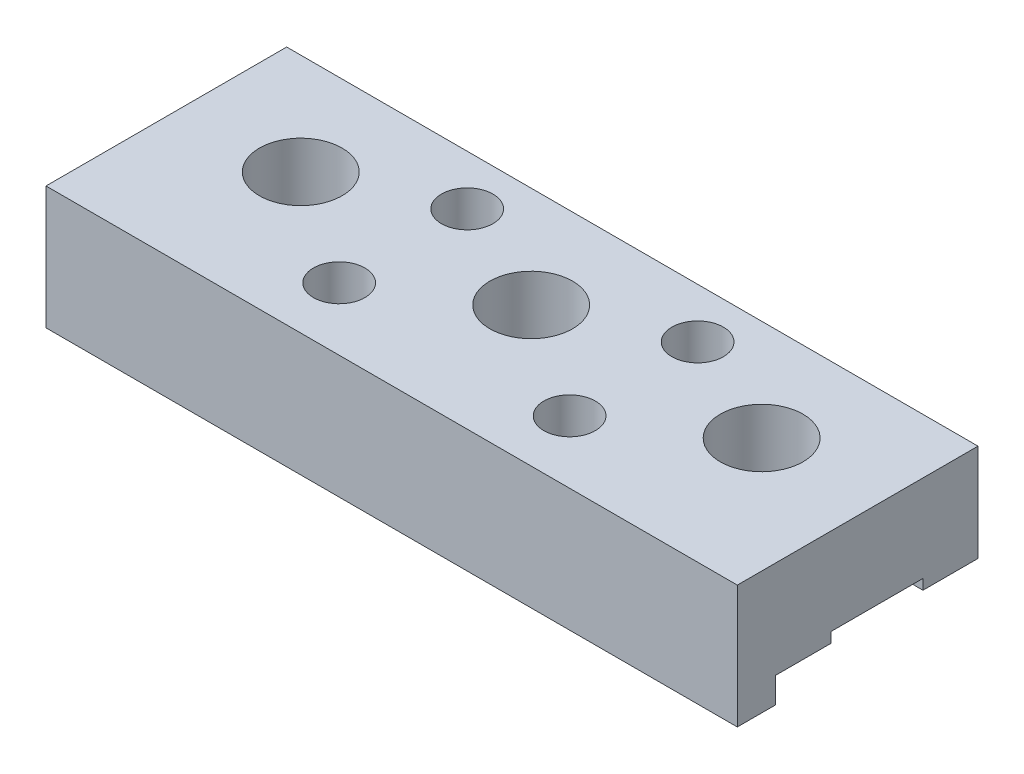
ISO-10303-21;
HEADER;
FILE_DESCRIPTION(('STEP AP214'),'2;1');
FILE_NAME('part.step','',(''),(''),'','','');
FILE_SCHEMA(('AUTOMOTIVE_DESIGN { 1 0 10303 214 1 1 1 1 }'));
ENDSEC;
DATA;
#1=APPLICATION_CONTEXT('core data for automotive mechanical design processes');
#2=APPLICATION_PROTOCOL_DEFINITION('international standard','automotive_design',2000,#1);
#3=PRODUCT_CONTEXT('',#1,'mechanical');
#4=PRODUCT('Part','Part','',(#3));
#5=PRODUCT_RELATED_PRODUCT_CATEGORY('part','',(#4));
#6=PRODUCT_DEFINITION_FORMATION('','',#4);
#7=PRODUCT_DEFINITION_CONTEXT('part definition',#1,'design');
#8=PRODUCT_DEFINITION('design','',#6,#7);
#9=PRODUCT_DEFINITION_SHAPE('','',#8);
#10=(LENGTH_UNIT() NAMED_UNIT(*) SI_UNIT(.MILLI.,.METRE.));
#11=(NAMED_UNIT(*) PLANE_ANGLE_UNIT() SI_UNIT($,.RADIAN.));
#12=(NAMED_UNIT(*) SI_UNIT($,.STERADIAN.) SOLID_ANGLE_UNIT());
#13=UNCERTAINTY_MEASURE_WITH_UNIT(LENGTH_MEASURE(1.E-05),#10,'distance_accuracy_value','');
#14=(GEOMETRIC_REPRESENTATION_CONTEXT(3) GLOBAL_UNCERTAINTY_ASSIGNED_CONTEXT((#13)) GLOBAL_UNIT_ASSIGNED_CONTEXT((#10,
#11,#12)) REPRESENTATION_CONTEXT('',''));
#15=CARTESIAN_POINT('',(0.,0.,0.));
#16=DIRECTION('',(0.,0.,1.));
#17=DIRECTION('',(1.,0.,0.));
#18=AXIS2_PLACEMENT_3D('',#15,#16,#17);
#19=CARTESIAN_POINT('',(-34.2899999999999,1.01600000000013,-4.62279999999993));
#20=DIRECTION('',(0.,0.,-1.));
#21=DIRECTION('',(-1.,0.,0.));
#22=AXIS2_PLACEMENT_3D('',#19,#20,#21);
#23=PLANE('',#22);
#24=DIRECTION('',(1.,0.,0.));
#25=VECTOR('',#24,1.);
#26=CARTESIAN_POINT('',(-34.2899999999999,-2.22044604925031E-13,-4.62279999999987));
#27=LINE('',#26,#25);
#28=CARTESIAN_POINT('',(-34.2899999999999,-2.22044604925031E-13,-4.62279999999987));
#29=VERTEX_POINT('',#28);
#30=CARTESIAN_POINT('',(-13.9316421186892,-2.22044604925031E-13,-4.62279999999987));
#31=VERTEX_POINT('',#30);
#32=EDGE_CURVE('E177',#29,#31,#27,.T.);
#33=ORIENTED_EDGE('',*,*,#32,.T.);
#34=DIRECTION('',(0.,1.,0.));
#35=VECTOR('',#34,1.);
#36=CARTESIAN_POINT('',(-13.9316421186892,9.65199999999977,-4.62279999999987));
#37=LINE('',#36,#35);
#38=CARTESIAN_POINT('',(-13.9316421186892,1.01599999999968,-4.62279999999993));
#39=VERTEX_POINT('',#38);
#40=EDGE_CURVE('E165',#31,#39,#37,.T.);
#41=ORIENTED_EDGE('',*,*,#40,.T.);
#42=DIRECTION('',(1.,0.,0.));
#43=VECTOR('',#42,1.);
#44=CARTESIAN_POINT('',(-34.2899999999999,1.01600000000013,-4.62279999999993));
#45=LINE('',#44,#43);
#46=CARTESIAN_POINT('',(-34.2899999999999,1.01600000000013,-4.62279999999993));
#47=VERTEX_POINT('',#46);
#48=EDGE_CURVE('E174',#47,#39,#45,.T.);
#49=ORIENTED_EDGE('',*,*,#48,.F.);
#50=DIRECTION('',(0.,-1.,0.));
#51=VECTOR('',#50,1.);
#52=CARTESIAN_POINT('',(-34.2899999999999,1.01600000000013,-4.62279999999993));
#53=LINE('',#52,#51);
#54=EDGE_CURVE('E367',#47,#29,#53,.T.);
#55=ORIENTED_EDGE('',*,*,#54,.T.);
#56=EDGE_LOOP('',(#33,#41,#49,#55));
#57=FACE_BOUND('',#56,.T.);
#58=ADVANCED_FACE('F42',(#57),#23,.F.);
#59=CARTESIAN_POINT('',(-34.2900000000002,-73.7657517975891,9.98220000000005));
#60=DIRECTION('',(0.,0.,-1.));
#61=DIRECTION('',(-1.,0.,0.));
#62=AXIS2_PLACEMENT_3D('',#59,#60,#61);
#63=PLANE('',#62);
#64=DIRECTION('',(0.,1.,0.));
#65=VECTOR('',#64,1.);
#66=CARTESIAN_POINT('',(-12.2628915235492,9.65199999999977,9.9822));
#67=LINE('',#66,#65);
#68=CARTESIAN_POINT('',(-12.262891523549,-2.54000000000021,9.9822));
#69=VERTEX_POINT('',#68);
#70=CARTESIAN_POINT('',(-12.262891523549,-2.22044604925031E-13,9.98220000000005));
#71=VERTEX_POINT('',#70);
#72=EDGE_CURVE('E236',#69,#71,#67,.T.);
#73=ORIENTED_EDGE('',*,*,#72,.F.);
#74=DIRECTION('',(1.,0.,0.));
#75=VECTOR('',#74,1.);
#76=CARTESIAN_POINT('',(-34.2899999999999,-2.54000000000043,9.98220000000005));
#77=LINE('',#76,#75);
#78=CARTESIAN_POINT('',(-34.2899999999999,-2.54000000000043,9.98220000000005));
#79=VERTEX_POINT('',#78);
#80=EDGE_CURVE('E287',#79,#69,#77,.T.);
#81=ORIENTED_EDGE('',*,*,#80,.F.);
#82=DIRECTION('',(0.,1.,0.));
#83=VECTOR('',#82,1.);
#84=CARTESIAN_POINT('',(-34.2900000000002,-73.7657517975891,9.98220000000005));
#85=LINE('',#84,#83);
#86=CARTESIAN_POINT('',(-34.2899999999999,0.,9.98220000000011));
#87=VERTEX_POINT('',#86);
#88=EDGE_CURVE('E286',#79,#87,#85,.T.);
#89=ORIENTED_EDGE('',*,*,#88,.T.);
#90=DIRECTION('',(-1.,0.,0.));
#91=VECTOR('',#90,1.);
#92=CARTESIAN_POINT('',(34.2899999999999,0.,9.98220000000008));
#93=LINE('',#92,#91);
#94=EDGE_CURVE('E310',#71,#87,#93,.T.);
#95=ORIENTED_EDGE('',*,*,#94,.F.);
#96=EDGE_LOOP('',(#73,#81,#89,#95));
#97=FACE_BOUND('',#96,.T.);
#98=ADVANCED_FACE('F398',(#97),#63,.T.);
#99=DIRECTION('',(0.,1.,0.));
#100=VECTOR('',#99,1.);
#101=CARTESIAN_POINT('',(-10.5971084764509,9.65199999999977,9.9822));
#102=LINE('',#101,#100);
#103=CARTESIAN_POINT('',(-10.5971084764509,-2.22044604925031E-13,9.98220000000005));
#104=VERTEX_POINT('',#103);
#105=CARTESIAN_POINT('',(-10.5971084764509,-2.54000000000021,9.9822));
#106=VERTEX_POINT('',#105);
#107=EDGE_CURVE('E64',#104,#106,#102,.F.);
#108=ORIENTED_EDGE('',*,*,#107,.F.);
#109=CARTESIAN_POINT('',(10.5971084764509,-4.44089209850063E-13,9.98220000000011));
#110=VERTEX_POINT('',#109);
#111=EDGE_CURVE('E320',#110,#104,#93,.T.);
#112=ORIENTED_EDGE('',*,*,#111,.F.);
#113=DIRECTION('',(0.,1.,0.));
#114=VECTOR('',#113,1.);
#115=CARTESIAN_POINT('',(10.5971084764509,9.65199999999955,9.98219999999994));
#116=LINE('',#115,#114);
#117=CARTESIAN_POINT('',(10.5971084764509,-2.54000000000043,9.98220000000005));
#118=VERTEX_POINT('',#117);
#119=EDGE_CURVE('E226',#118,#110,#116,.T.);
#120=ORIENTED_EDGE('',*,*,#119,.F.);
#121=EDGE_CURVE('E291',#106,#118,#77,.T.);
#122=ORIENTED_EDGE('',*,*,#121,.F.);
#123=EDGE_LOOP('',(#108,#112,#120,#122));
#124=FACE_BOUND('',#123,.T.);
#125=ADVANCED_FACE('F341',(#124),#63,.T.);
#126=CARTESIAN_POINT('',(-8.92835788131086,1.01599999999991,-4.62280000000009));
#127=VERTEX_POINT('',#126);
#128=CARTESIAN_POINT('',(8.92835788131086,1.01599999999991,-4.62280000000004));
#129=VERTEX_POINT('',#128);
#130=EDGE_CURVE('E187',#127,#129,#45,.T.);
#131=ORIENTED_EDGE('',*,*,#130,.F.);
#132=DIRECTION('',(0.,1.,0.));
#133=VECTOR('',#132,1.);
#134=CARTESIAN_POINT('',(-8.92835788131086,9.65199999999999,-4.62279999999987));
#135=LINE('',#134,#133);
#136=CARTESIAN_POINT('',(-8.92835788131086,0.,-4.62279999999998));
#137=VERTEX_POINT('',#136);
#138=EDGE_CURVE('E56',#127,#137,#135,.F.);
#139=ORIENTED_EDGE('',*,*,#138,.T.);
#140=CARTESIAN_POINT('',(8.92835788131086,0.,-4.62279999999998));
#141=VERTEX_POINT('',#140);
#142=EDGE_CURVE('E567',#137,#141,#27,.T.);
#143=ORIENTED_EDGE('',*,*,#142,.T.);
#144=DIRECTION('',(0.,1.,0.));
#145=VECTOR('',#144,1.);
#146=CARTESIAN_POINT('',(8.92835788131063,9.65199999999999,-4.62279999999987));
#147=LINE('',#146,#145);
#148=EDGE_CURVE('E328',#141,#129,#147,.T.);
#149=ORIENTED_EDGE('',*,*,#148,.T.);
#150=EDGE_LOOP('',(#131,#139,#143,#149));
#151=FACE_BOUND('',#150,.T.);
#152=ADVANCED_FACE('F393',(#151),#23,.F.);
#153=CARTESIAN_POINT('',(34.2900000000002,0.,11.43));
#154=DIRECTION('',(0.,1.,0.));
#155=DIRECTION('',(0.,0.,1.));
#156=AXIS2_PLACEMENT_3D('',#153,#154,#155);
#157=PLANE('',#156);
#158=ORIENTED_EDGE('',*,*,#142,.F.);
#159=CARTESIAN_POINT('',(-11.4300000000001,-2.22044604925031E-13,-5.13080000000005));
#160=DIRECTION('',(0.,1.,0.));
#161=DIRECTION('',(0.,0.,1.));
#162=AXIS2_PLACEMENT_3D('',#159,#160,#161);
#163=CIRCLE('',#162,2.5527);
#164=EDGE_CURVE('E179',#137,#31,#163,.T.);
#165=ORIENTED_EDGE('',*,*,#164,.T.);
#166=ORIENTED_EDGE('',*,*,#32,.F.);
#167=DIRECTION('',(0.,0.,1.));
#168=VECTOR('',#167,1.);
#169=CARTESIAN_POINT('',(-34.2899999999999,0.,-11.4300000000001));
#170=LINE('',#169,#168);
#171=CARTESIAN_POINT('',(-34.2899999999999,0.,-10.0838));
#172=VERTEX_POINT('',#171);
#173=EDGE_CURVE('E308',#172,#29,#170,.T.);
#174=ORIENTED_EDGE('',*,*,#173,.F.);
#175=DIRECTION('',(-1.,0.,0.));
#176=VECTOR('',#175,1.);
#177=CARTESIAN_POINT('',(34.2899999999999,0.,-10.0837999999999));
#178=LINE('',#177,#176);
#179=CARTESIAN_POINT('',(34.2899999999999,0.,-10.0837999999999));
#180=VERTEX_POINT('',#179);
#181=EDGE_CURVE('E210',#180,#172,#178,.T.);
#182=ORIENTED_EDGE('',*,*,#181,.F.);
#183=DIRECTION('',(0.,0.,-1.));
#184=VECTOR('',#183,1.);
#185=CARTESIAN_POINT('',(34.2899999999999,0.,-11.43));
#186=LINE('',#185,#184);
#187=CARTESIAN_POINT('',(34.2899999999999,0.,-4.62280000000001));
#188=VERTEX_POINT('',#187);
#189=EDGE_CURVE('E304',#188,#180,#186,.T.);
#190=ORIENTED_EDGE('',*,*,#189,.F.);
#191=CARTESIAN_POINT('',(13.9316421186892,0.,-4.62280000000004));
#192=VERTEX_POINT('',#191);
#193=EDGE_CURVE('E418',#192,#188,#27,.T.);
#194=ORIENTED_EDGE('',*,*,#193,.F.);
#195=CARTESIAN_POINT('',(11.4300000000001,-2.22044604925031E-13,-5.13080000000005));
#196=DIRECTION('',(0.,1.,0.));
#197=DIRECTION('',(0.,0.,1.));
#198=AXIS2_PLACEMENT_3D('',#195,#196,#197);
#199=CIRCLE('',#198,2.5527);
#200=EDGE_CURVE('E212',#192,#141,#199,.T.);
#201=ORIENTED_EDGE('',*,*,#200,.T.);
#202=EDGE_LOOP('',(#158,#165,#166,#174,#182,#190,#194,#201));
#203=FACE_BOUND('',#202,.T.);
#204=ADVANCED_FACE('F384',(#203),#157,.F.);
#205=CARTESIAN_POINT('',(0.,0.,-0.0508000000000175));
#206=DIRECTION('',(0.,-1.,0.));
#207=DIRECTION('',(0.,0.,-1.));
#208=AXIS2_PLACEMENT_3D('',#205,#206,#207);
#209=CYLINDRICAL_SURFACE('',#208,4.1021);
#210=CARTESIAN_POINT('',(0.,9.65199999999999,-0.050800000000073));
#211=DIRECTION('',(0.,-1.,0.));
#212=DIRECTION('',(0.,0.,-1.));
#213=AXIS2_PLACEMENT_3D('',#210,#211,#212);
#214=CIRCLE('',#213,4.1021);
#215=CARTESIAN_POINT('',(0.,9.652,-4.15290000000007));
#216=VERTEX_POINT('',#215);
#217=EDGE_CURVE('E273',#216,#216,#214,.T.);
#218=ORIENTED_EDGE('',*,*,#217,.F.);
#219=EDGE_LOOP('',(#218));
#220=FACE_BOUND('',#219,.T.);
#221=CARTESIAN_POINT('',(0.,1.01599999999991,-0.0508000000000175));
#222=DIRECTION('',(0.,-1.,0.));
#223=DIRECTION('',(0.,0.,-1.));
#224=AXIS2_PLACEMENT_3D('',#221,#222,#223);
#225=CIRCLE('',#224,4.1021);
#226=CARTESIAN_POINT('',(0.,1.01599999999991,-4.15290000000002));
#227=VERTEX_POINT('',#226);
#228=EDGE_CURVE('E376',#227,#227,#225,.F.);
#229=ORIENTED_EDGE('',*,*,#228,.F.);
#230=EDGE_LOOP('',(#229));
#231=FACE_BOUND('',#230,.T.);
#232=ADVANCED_FACE('F381',(#220,#231),#209,.F.);
#233=CARTESIAN_POINT('',(22.8600000000001,0.,-0.0507999999999342));
#234=DIRECTION('',(0.,-1.,0.));
#235=DIRECTION('',(0.,0.,-1.));
#236=AXIS2_PLACEMENT_3D('',#233,#234,#235);
#237=CYLINDRICAL_SURFACE('',#236,4.1021);
#238=CARTESIAN_POINT('',(22.8599999999999,9.65199999999977,-0.0507999999999342));
#239=DIRECTION('',(0.,-1.,0.));
#240=DIRECTION('',(0.,0.,-1.));
#241=AXIS2_PLACEMENT_3D('',#238,#239,#240);
#242=CIRCLE('',#241,4.1021);
#243=CARTESIAN_POINT('',(22.8599999999999,9.65199999999977,-4.15289999999993));
#244=VERTEX_POINT('',#243);
#245=EDGE_CURVE('E270',#244,#244,#242,.T.);
#246=ORIENTED_EDGE('',*,*,#245,.F.);
#247=EDGE_LOOP('',(#246));
#248=FACE_BOUND('',#247,.T.);
#249=CARTESIAN_POINT('',(22.8600000000001,1.01599999999991,-0.0507999999999342));
#250=DIRECTION('',(0.,-1.,0.));
#251=DIRECTION('',(0.,0.,-1.));
#252=AXIS2_PLACEMENT_3D('',#249,#250,#251);
#253=CIRCLE('',#252,4.1021);
#254=CARTESIAN_POINT('',(22.8600000000001,1.01599999999991,-4.15289999999993));
#255=VERTEX_POINT('',#254);
#256=EDGE_CURVE('E324',#255,#255,#253,.F.);
#257=ORIENTED_EDGE('',*,*,#256,.F.);
#258=EDGE_LOOP('',(#257));
#259=FACE_BOUND('',#258,.T.);
#260=ADVANCED_FACE('F383',(#248,#259),#237,.F.);
#261=CARTESIAN_POINT('',(-22.8600000000001,0.,-0.050799999999962));
#262=DIRECTION('',(0.,-1.,0.));
#263=DIRECTION('',(0.,0.,-1.));
#264=AXIS2_PLACEMENT_3D('',#261,#262,#263);
#265=CYLINDRICAL_SURFACE('',#264,4.1021);
#266=CARTESIAN_POINT('',(-22.8600000000001,9.65199999999977,-0.050799999999962));
#267=DIRECTION('',(0.,-1.,0.));
#268=DIRECTION('',(0.,0.,-1.));
#269=AXIS2_PLACEMENT_3D('',#266,#267,#268);
#270=CIRCLE('',#269,4.1021);
#271=CARTESIAN_POINT('',(-22.8600000000001,9.65199999999977,-4.15289999999996));
#272=VERTEX_POINT('',#271);
#273=EDGE_CURVE('E266',#272,#272,#270,.T.);
#274=ORIENTED_EDGE('',*,*,#273,.F.);
#275=EDGE_LOOP('',(#274));
#276=FACE_BOUND('',#275,.T.);
#277=CARTESIAN_POINT('',(-22.8600000000001,1.01599999999991,-0.050799999999962));
#278=DIRECTION('',(0.,-1.,0.));
#279=DIRECTION('',(0.,0.,-1.));
#280=AXIS2_PLACEMENT_3D('',#277,#278,#279);
#281=CIRCLE('',#280,4.1021);
#282=CARTESIAN_POINT('',(-22.8600000000001,1.01599999999991,-4.15289999999996));
#283=VERTEX_POINT('',#282);
#284=EDGE_CURVE('E321',#283,#283,#281,.F.);
#285=ORIENTED_EDGE('',*,*,#284,.F.);
#286=EDGE_LOOP('',(#285));
#287=FACE_BOUND('',#286,.T.);
#288=ADVANCED_FACE('F390',(#276,#287),#265,.F.);
#289=CARTESIAN_POINT('',(34.2899999999999,9.65199999999999,-11.4299999999998));
#290=DIRECTION('',(-1.,0.,0.));
#291=DIRECTION('',(0.,0.,1.));
#292=AXIS2_PLACEMENT_3D('',#289,#290,#291);
#293=PLANE('',#292);
#294=ORIENTED_EDGE('',*,*,#189,.T.);
#295=DIRECTION('',(0.,-1.,0.));
#296=VECTOR('',#295,1.);
#297=CARTESIAN_POINT('',(34.2899999999999,9.65199999999977,-10.0838000000001));
#298=LINE('',#297,#296);
#299=CARTESIAN_POINT('',(34.2899999999999,9.65199999999977,-10.0838000000001));
#300=VERTEX_POINT('',#299);
#301=EDGE_CURVE('E203',#300,#180,#298,.T.);
#302=ORIENTED_EDGE('',*,*,#301,.F.);
#303=DIRECTION('',(0.,0.,-1.));
#304=VECTOR('',#303,1.);
#305=CARTESIAN_POINT('',(34.2899999999999,9.65199999999999,-11.4299999999998));
#306=LINE('',#305,#304);
#307=CARTESIAN_POINT('',(34.2899999999999,9.65199999999999,13.7922));
#308=VERTEX_POINT('',#307);
#309=EDGE_CURVE('E305',#308,#300,#306,.T.);
#310=ORIENTED_EDGE('',*,*,#309,.F.);
#311=DIRECTION('',(0.,1.,0.));
#312=VECTOR('',#311,1.);
#313=CARTESIAN_POINT('',(34.2899999999999,-73.7657517975891,13.7922000000001));
#314=LINE('',#313,#312);
#315=CARTESIAN_POINT('',(34.2900000000002,-2.53999999999999,13.7922000000001));
#316=VERTEX_POINT('',#315);
#317=EDGE_CURVE('E298',#316,#308,#314,.T.);
#318=ORIENTED_EDGE('',*,*,#317,.F.);
#319=DIRECTION('',(0.,0.,1.));
#320=VECTOR('',#319,1.);
#321=CARTESIAN_POINT('',(34.2900000000002,-2.54000000000021,9.98220000000008));
#322=LINE('',#321,#320);
#323=CARTESIAN_POINT('',(34.2900000000002,-2.54000000000021,9.98220000000008));
#324=VERTEX_POINT('',#323);
#325=EDGE_CURVE('E283',#324,#316,#322,.T.);
#326=ORIENTED_EDGE('',*,*,#325,.F.);
#327=DIRECTION('',(0.,1.,0.));
#328=VECTOR('',#327,1.);
#329=CARTESIAN_POINT('',(34.2899999999999,-73.7657517975891,9.98220000000019));
#330=LINE('',#329,#328);
#331=CARTESIAN_POINT('',(34.2899999999999,0.,9.98220000000008));
#332=VERTEX_POINT('',#331);
#333=EDGE_CURVE('E296',#324,#332,#330,.T.);
#334=ORIENTED_EDGE('',*,*,#333,.T.);
#335=CARTESIAN_POINT('',(34.2899999999999,0.,4.52120000000003));
#336=VERTEX_POINT('',#335);
#337=EDGE_CURVE('E311',#332,#336,#186,.T.);
#338=ORIENTED_EDGE('',*,*,#337,.T.);
#339=DIRECTION('',(0.,-1.,0.));
#340=VECTOR('',#339,1.);
#341=CARTESIAN_POINT('',(34.2899999999999,1.01599999999991,4.52120000000009));
#342=LINE('',#341,#340);
#343=CARTESIAN_POINT('',(34.2899999999999,1.01599999999991,4.52120000000009));
#344=VERTEX_POINT('',#343);
#345=EDGE_CURVE('E186',#344,#336,#342,.T.);
#346=ORIENTED_EDGE('',*,*,#345,.F.);
#347=DIRECTION('',(0.,0.,1.));
#348=VECTOR('',#347,1.);
#349=CARTESIAN_POINT('',(34.2899999999999,1.01599999999991,4.52120000000009));
#350=LINE('',#349,#348);
#351=CARTESIAN_POINT('',(34.2899999999999,1.01599999999991,-4.62280000000001));
#352=VERTEX_POINT('',#351);
#353=EDGE_CURVE('E199',#352,#344,#350,.T.);
#354=ORIENTED_EDGE('',*,*,#353,.F.);
#355=DIRECTION('',(0.,-1.,0.));
#356=VECTOR('',#355,1.);
#357=CARTESIAN_POINT('',(34.2899999999999,1.01599999999991,-4.62280000000001));
#358=LINE('',#357,#356);
#359=EDGE_CURVE('E325',#352,#188,#358,.T.);
#360=ORIENTED_EDGE('',*,*,#359,.T.);
#361=EDGE_LOOP('',(#294,#302,#310,#318,#326,#334,#338,#346,#354,#360));
#362=FACE_BOUND('',#361,.T.);
#363=ADVANCED_FACE('F44',(#362),#293,.F.);
#364=CARTESIAN_POINT('',(-34.2900000000002,9.65199999999977,-11.43));
#365=DIRECTION('',(1.,0.,0.));
#366=DIRECTION('',(0.,0.,-1.));
#367=AXIS2_PLACEMENT_3D('',#364,#365,#366);
#368=PLANE('',#367);
#369=DIRECTION('',(0.,0.,1.));
#370=VECTOR('',#369,1.);
#371=CARTESIAN_POINT('',(-34.2900000000002,9.65199999999977,-11.43));
#372=LINE('',#371,#370);
#373=CARTESIAN_POINT('',(-34.2900000000002,9.65199999999977,-10.0838));
#374=VERTEX_POINT('',#373);
#375=CARTESIAN_POINT('',(-34.2899999999999,9.65199999999999,13.7922));
#376=VERTEX_POINT('',#375);
#377=EDGE_CURVE('E307',#374,#376,#372,.T.);
#378=ORIENTED_EDGE('',*,*,#377,.F.);
#379=DIRECTION('',(0.,-1.,0.));
#380=VECTOR('',#379,1.);
#381=CARTESIAN_POINT('',(-34.2900000000002,9.65199999999977,-10.0838));
#382=LINE('',#381,#380);
#383=EDGE_CURVE('E205',#374,#172,#382,.T.);
#384=ORIENTED_EDGE('',*,*,#383,.T.);
#385=ORIENTED_EDGE('',*,*,#173,.T.);
#386=ORIENTED_EDGE('',*,*,#54,.F.);
#387=DIRECTION('',(0.,0.,-1.));
#388=VECTOR('',#387,1.);
#389=CARTESIAN_POINT('',(-34.2899999999999,1.01599999999991,4.52120000000006));
#390=LINE('',#389,#388);
#391=CARTESIAN_POINT('',(-34.2899999999999,1.01599999999991,4.52120000000006));
#392=VERTEX_POINT('',#391);
#393=EDGE_CURVE('E185',#392,#47,#390,.T.);
#394=ORIENTED_EDGE('',*,*,#393,.F.);
#395=DIRECTION('',(0.,-1.,0.));
#396=VECTOR('',#395,1.);
#397=CARTESIAN_POINT('',(-34.2899999999999,1.01599999999991,4.52120000000006));
#398=LINE('',#397,#396);
#399=CARTESIAN_POINT('',(-34.2899999999999,0.,4.52120000000011));
#400=VERTEX_POINT('',#399);
#401=EDGE_CURVE('E190',#392,#400,#398,.T.);
#402=ORIENTED_EDGE('',*,*,#401,.T.);
#403=EDGE_CURVE('E314',#400,#87,#170,.T.);
#404=ORIENTED_EDGE('',*,*,#403,.T.);
#405=ORIENTED_EDGE('',*,*,#88,.F.);
#406=DIRECTION('',(0.,0.,-1.));
#407=VECTOR('',#406,1.);
#408=CARTESIAN_POINT('',(-34.2899999999999,-2.54000000000043,9.98220000000005));
#409=LINE('',#408,#407);
#410=CARTESIAN_POINT('',(-34.2899999999999,-2.54000000000021,13.7922000000001));
#411=VERTEX_POINT('',#410);
#412=EDGE_CURVE('E290',#411,#79,#409,.T.);
#413=ORIENTED_EDGE('',*,*,#412,.F.);
#414=DIRECTION('',(0.,1.,0.));
#415=VECTOR('',#414,1.);
#416=CARTESIAN_POINT('',(-34.2899999999999,-73.7657517975891,13.7922));
#417=LINE('',#416,#415);
#418=EDGE_CURVE('E278',#411,#376,#417,.T.);
#419=ORIENTED_EDGE('',*,*,#418,.T.);
#420=EDGE_LOOP('',(#378,#384,#385,#386,#394,#402,#404,#405,#413,#419));
#421=FACE_BOUND('',#420,.T.);
#422=ADVANCED_FACE('F252',(#421),#368,.F.);
#423=CARTESIAN_POINT('',(34.2899999999999,9.65199999999999,11.43));
#424=DIRECTION('',(0.,1.,0.));
#425=DIRECTION('',(0.,0.,1.));
#426=AXIS2_PLACEMENT_3D('',#423,#424,#425);
#427=PLANE('',#426);
#428=CARTESIAN_POINT('',(-11.4300000000001,9.65199999999977,-5.13079999999999));
#429=DIRECTION('',(0.,1.,0.));
#430=DIRECTION('',(0.,0.,1.));
#431=AXIS2_PLACEMENT_3D('',#428,#429,#430);
#432=CIRCLE('',#431,2.5527);
#433=CARTESIAN_POINT('',(-11.4300000000001,9.65199999999977,-2.57809999999999));
#434=VERTEX_POINT('',#433);
#435=EDGE_CURVE('E243',#434,#434,#432,.T.);
#436=ORIENTED_EDGE('',*,*,#435,.F.);
#437=EDGE_LOOP('',(#436));
#438=FACE_BOUND('',#437,.T.);
#439=CARTESIAN_POINT('',(-11.4300000000001,9.65199999999977,7.5692));
#440=DIRECTION('',(0.,1.,0.));
#441=DIRECTION('',(0.,0.,1.));
#442=AXIS2_PLACEMENT_3D('',#439,#440,#441);
#443=CIRCLE('',#442,2.5527);
#444=CARTESIAN_POINT('',(-11.4300000000001,9.65199999999977,10.1219));
#445=VERTEX_POINT('',#444);
#446=EDGE_CURVE('E178',#445,#445,#443,.T.);
#447=ORIENTED_EDGE('',*,*,#446,.F.);
#448=EDGE_LOOP('',(#447));
#449=FACE_BOUND('',#448,.T.);
#450=CARTESIAN_POINT('',(11.4300000000001,9.65199999999977,7.5692));
#451=DIRECTION('',(0.,1.,0.));
#452=DIRECTION('',(0.,0.,1.));
#453=AXIS2_PLACEMENT_3D('',#450,#451,#452);
#454=CIRCLE('',#453,2.5527);
#455=CARTESIAN_POINT('',(11.4300000000001,9.65199999999977,10.1219));
#456=VERTEX_POINT('',#455);
#457=EDGE_CURVE('E230',#456,#456,#454,.T.);
#458=ORIENTED_EDGE('',*,*,#457,.F.);
#459=EDGE_LOOP('',(#458));
#460=FACE_BOUND('',#459,.T.);
#461=CARTESIAN_POINT('',(11.4300000000001,9.65199999999977,-5.13079999999999));
#462=DIRECTION('',(0.,1.,0.));
#463=DIRECTION('',(0.,0.,1.));
#464=AXIS2_PLACEMENT_3D('',#461,#462,#463);
#465=CIRCLE('',#464,2.5527);
#466=CARTESIAN_POINT('',(11.4300000000001,9.65199999999977,-2.57809999999999));
#467=VERTEX_POINT('',#466);
#468=EDGE_CURVE('E220',#467,#467,#465,.T.);
#469=ORIENTED_EDGE('',*,*,#468,.F.);
#470=EDGE_LOOP('',(#469));
#471=FACE_BOUND('',#470,.T.);
#472=DIRECTION('',(-1.,0.,0.));
#473=VECTOR('',#472,1.);
#474=CARTESIAN_POINT('',(34.2899999999999,9.65199999999977,-10.0838000000001));
#475=LINE('',#474,#473);
#476=EDGE_CURVE('E206',#300,#374,#475,.T.);
#477=ORIENTED_EDGE('',*,*,#476,.T.);
#478=ORIENTED_EDGE('',*,*,#377,.T.);
#479=DIRECTION('',(1.,0.,0.));
#480=VECTOR('',#479,1.);
#481=CARTESIAN_POINT('',(-34.2899999999999,9.65199999999999,13.7922));
#482=LINE('',#481,#480);
#483=EDGE_CURVE('E275',#376,#308,#482,.T.);
#484=ORIENTED_EDGE('',*,*,#483,.T.);
#485=ORIENTED_EDGE('',*,*,#309,.T.);
#486=EDGE_LOOP('',(#477,#478,#484,#485));
#487=FACE_BOUND('',#486,.T.);
#488=ORIENTED_EDGE('',*,*,#273,.T.);
#489=EDGE_LOOP('',(#488));
#490=FACE_BOUND('',#489,.T.);
#491=ORIENTED_EDGE('',*,*,#245,.T.);
#492=EDGE_LOOP('',(#491));
#493=FACE_BOUND('',#492,.T.);
#494=ORIENTED_EDGE('',*,*,#217,.T.);
#495=EDGE_LOOP('',(#494));
#496=FACE_BOUND('',#495,.T.);
#497=ADVANCED_FACE('F248',(#438,#449,#460,#471,#487,#490,#493,#496),#427,.T.);
#498=ORIENTED_EDGE('',*,*,#111,.T.);
#499=CARTESIAN_POINT('',(-11.4300000000001,-2.22044604925031E-13,7.5692));
#500=DIRECTION('',(0.,1.,0.));
#501=DIRECTION('',(0.,0.,1.));
#502=AXIS2_PLACEMENT_3D('',#499,#500,#501);
#503=CIRCLE('',#502,2.5527);
#504=EDGE_CURVE('E233',#104,#71,#503,.T.);
#505=ORIENTED_EDGE('',*,*,#504,.T.);
#506=ORIENTED_EDGE('',*,*,#94,.T.);
#507=ORIENTED_EDGE('',*,*,#403,.F.);
#508=DIRECTION('',(-1.,0.,0.));
#509=VECTOR('',#508,1.);
#510=CARTESIAN_POINT('',(-34.2899999999999,0.,4.52120000000011));
#511=LINE('',#510,#509);
#512=EDGE_CURVE('E209',#336,#400,#511,.T.);
#513=ORIENTED_EDGE('',*,*,#512,.F.);
#514=ORIENTED_EDGE('',*,*,#337,.F.);
#515=CARTESIAN_POINT('',(12.2628915235492,-4.44089209850063E-13,9.98220000000011));
#516=VERTEX_POINT('',#515);
#517=EDGE_CURVE('E316',#332,#516,#93,.T.);
#518=ORIENTED_EDGE('',*,*,#517,.T.);
#519=CARTESIAN_POINT('',(11.4300000000001,-2.22044604925031E-13,7.5692));
#520=DIRECTION('',(0.,1.,0.));
#521=DIRECTION('',(0.,0.,1.));
#522=AXIS2_PLACEMENT_3D('',#519,#520,#521);
#523=CIRCLE('',#522,2.5527);
#524=EDGE_CURVE('E223',#516,#110,#523,.T.);
#525=ORIENTED_EDGE('',*,*,#524,.T.);
#526=EDGE_LOOP('',(#498,#505,#506,#507,#513,#514,#518,#525));
#527=FACE_BOUND('',#526,.T.);
#528=ADVANCED_FACE('F251',(#527),#157,.F.);
#529=DIRECTION('',(0.,1.,0.));
#530=VECTOR('',#529,1.);
#531=CARTESIAN_POINT('',(12.2628915235492,9.65199999999955,9.98219999999994));
#532=LINE('',#531,#530);
#533=CARTESIAN_POINT('',(12.2628915235492,-2.54000000000043,9.98220000000005));
#534=VERTEX_POINT('',#533);
#535=EDGE_CURVE('E228',#516,#534,#532,.F.);
#536=ORIENTED_EDGE('',*,*,#535,.F.);
#537=ORIENTED_EDGE('',*,*,#517,.F.);
#538=ORIENTED_EDGE('',*,*,#333,.F.);
#539=EDGE_CURVE('E285',#534,#324,#77,.T.);
#540=ORIENTED_EDGE('',*,*,#539,.F.);
#541=EDGE_LOOP('',(#536,#537,#538,#540));
#542=FACE_BOUND('',#541,.T.);
#543=ADVANCED_FACE('F354',(#542),#63,.T.);
#544=CARTESIAN_POINT('',(-34.2899999999999,-73.7657517975891,13.7922));
#545=DIRECTION('',(0.,0.,1.));
#546=DIRECTION('',(1.,0.,0.));
#547=AXIS2_PLACEMENT_3D('',#544,#545,#546);
#548=PLANE('',#547);
#549=DIRECTION('',(-1.,0.,0.));
#550=VECTOR('',#549,1.);
#551=CARTESIAN_POINT('',(-34.2899999999999,-2.54000000000021,13.7922000000001));
#552=LINE('',#551,#550);
#553=EDGE_CURVE('E292',#316,#411,#552,.T.);
#554=ORIENTED_EDGE('',*,*,#553,.F.);
#555=ORIENTED_EDGE('',*,*,#317,.T.);
#556=ORIENTED_EDGE('',*,*,#483,.F.);
#557=ORIENTED_EDGE('',*,*,#418,.F.);
#558=EDGE_LOOP('',(#554,#555,#556,#557));
#559=FACE_BOUND('',#558,.T.);
#560=ADVANCED_FACE('F428',(#559),#548,.T.);
#561=CARTESIAN_POINT('',(34.2900000000002,-2.53999999999999,11.4300000000001));
#562=DIRECTION('',(0.,1.,0.));
#563=DIRECTION('',(0.,0.,1.));
#564=AXIS2_PLACEMENT_3D('',#561,#562,#563);
#565=PLANE('',#564);
#566=ORIENTED_EDGE('',*,*,#80,.T.);
#567=CARTESIAN_POINT('',(-11.4300000000001,-2.54000000000021,7.56920000000011));
#568=DIRECTION('',(0.,1.,0.));
#569=DIRECTION('',(0.,0.,1.));
#570=AXIS2_PLACEMENT_3D('',#567,#568,#569);
#571=CIRCLE('',#570,2.5527);
#572=EDGE_CURVE('E50',#69,#106,#571,.T.);
#573=ORIENTED_EDGE('',*,*,#572,.T.);
#574=ORIENTED_EDGE('',*,*,#121,.T.);
#575=CARTESIAN_POINT('',(11.4300000000001,-2.54000000000021,7.56920000000005));
#576=DIRECTION('',(0.,1.,0.));
#577=DIRECTION('',(0.,0.,1.));
#578=AXIS2_PLACEMENT_3D('',#575,#576,#577);
#579=CIRCLE('',#578,2.5527);
#580=EDGE_CURVE('E331',#118,#534,#579,.T.);
#581=ORIENTED_EDGE('',*,*,#580,.T.);
#582=ORIENTED_EDGE('',*,*,#539,.T.);
#583=ORIENTED_EDGE('',*,*,#325,.T.);
#584=ORIENTED_EDGE('',*,*,#553,.T.);
#585=ORIENTED_EDGE('',*,*,#412,.T.);
#586=EDGE_LOOP('',(#566,#573,#574,#581,#582,#583,#584,#585));
#587=FACE_BOUND('',#586,.T.);
#588=ADVANCED_FACE('F335',(#587),#565,.F.);
#589=CARTESIAN_POINT('',(34.2899999999999,1.01599999999991,-4.62280000000001));
#590=DIRECTION('',(0.,-1.,0.));
#591=DIRECTION('',(0.,0.,-1.));
#592=AXIS2_PLACEMENT_3D('',#589,#590,#591);
#593=PLANE('',#592);
#594=CARTESIAN_POINT('',(-11.4300000000001,1.01599999999968,-5.13079999999999));
#595=DIRECTION('',(0.,-1.,0.));
#596=DIRECTION('',(0.,0.,-1.));
#597=AXIS2_PLACEMENT_3D('',#594,#595,#596);
#598=CIRCLE('',#597,2.5527);
#599=EDGE_CURVE('E12',#127,#39,#598,.T.);
#600=ORIENTED_EDGE('',*,*,#599,.F.);
#601=ORIENTED_EDGE('',*,*,#130,.T.);
#602=CARTESIAN_POINT('',(11.4300000000001,1.01599999999968,-5.1308000000001));
#603=DIRECTION('',(0.,-1.,0.));
#604=DIRECTION('',(0.,0.,-1.));
#605=AXIS2_PLACEMENT_3D('',#602,#603,#604);
#606=CIRCLE('',#605,2.5527);
#607=CARTESIAN_POINT('',(13.9316421186892,1.01599999999991,-4.62280000000004));
#608=VERTEX_POINT('',#607);
#609=EDGE_CURVE('E217',#608,#129,#606,.T.);
#610=ORIENTED_EDGE('',*,*,#609,.F.);
#611=EDGE_CURVE('E189',#608,#352,#45,.T.);
#612=ORIENTED_EDGE('',*,*,#611,.T.);
#613=ORIENTED_EDGE('',*,*,#353,.T.);
#614=DIRECTION('',(-1.,0.,0.));
#615=VECTOR('',#614,1.);
#616=CARTESIAN_POINT('',(-34.2899999999999,1.01599999999991,4.52120000000006));
#617=LINE('',#616,#615);
#618=EDGE_CURVE('E198',#344,#392,#617,.T.);
#619=ORIENTED_EDGE('',*,*,#618,.T.);
#620=ORIENTED_EDGE('',*,*,#393,.T.);
#621=ORIENTED_EDGE('',*,*,#48,.T.);
#622=EDGE_LOOP('',(#600,#601,#610,#612,#613,#619,#620,#621));
#623=FACE_BOUND('',#622,.T.);
#624=ORIENTED_EDGE('',*,*,#256,.T.);
#625=EDGE_LOOP('',(#624));
#626=FACE_BOUND('',#625,.T.);
#627=ORIENTED_EDGE('',*,*,#284,.T.);
#628=EDGE_LOOP('',(#627));
#629=FACE_BOUND('',#628,.T.);
#630=ORIENTED_EDGE('',*,*,#228,.T.);
#631=EDGE_LOOP('',(#630));
#632=FACE_BOUND('',#631,.T.);
#633=ADVANCED_FACE('F181',(#623,#626,#629,#632),#593,.T.);
#634=ORIENTED_EDGE('',*,*,#611,.F.);
#635=DIRECTION('',(0.,1.,0.));
#636=VECTOR('',#635,1.);
#637=CARTESIAN_POINT('',(13.9316421186892,9.65199999999977,-4.62280000000004));
#638=LINE('',#637,#636);
#639=EDGE_CURVE('E319',#608,#192,#638,.F.);
#640=ORIENTED_EDGE('',*,*,#639,.T.);
#641=ORIENTED_EDGE('',*,*,#193,.T.);
#642=ORIENTED_EDGE('',*,*,#359,.F.);
#643=EDGE_LOOP('',(#634,#640,#641,#642));
#644=FACE_BOUND('',#643,.T.);
#645=ADVANCED_FACE('F400',(#644),#23,.F.);
#646=CARTESIAN_POINT('',(-34.2899999999999,1.01599999999991,4.52120000000006));
#647=DIRECTION('',(0.,0.,1.));
#648=DIRECTION('',(1.,0.,0.));
#649=AXIS2_PLACEMENT_3D('',#646,#647,#648);
#650=PLANE('',#649);
#651=ORIENTED_EDGE('',*,*,#512,.T.);
#652=ORIENTED_EDGE('',*,*,#401,.F.);
#653=ORIENTED_EDGE('',*,*,#618,.F.);
#654=ORIENTED_EDGE('',*,*,#345,.T.);
#655=EDGE_LOOP('',(#651,#652,#653,#654));
#656=FACE_BOUND('',#655,.T.);
#657=ADVANCED_FACE('F363',(#656),#650,.F.);
#658=CARTESIAN_POINT('',(34.2899999999999,9.65199999999977,-10.0838000000001));
#659=DIRECTION('',(0.,0.,1.));
#660=DIRECTION('',(1.,0.,0.));
#661=AXIS2_PLACEMENT_3D('',#658,#659,#660);
#662=PLANE('',#661);
#663=ORIENTED_EDGE('',*,*,#181,.T.);
#664=ORIENTED_EDGE('',*,*,#383,.F.);
#665=ORIENTED_EDGE('',*,*,#476,.F.);
#666=ORIENTED_EDGE('',*,*,#301,.T.);
#667=EDGE_LOOP('',(#663,#664,#665,#666));
#668=FACE_BOUND('',#667,.T.);
#669=ADVANCED_FACE('F416',(#668),#662,.F.);
#670=CARTESIAN_POINT('',(11.4300000000001,9.65199999999977,-5.13079999999999));
#671=DIRECTION('',(0.,1.,0.));
#672=DIRECTION('',(0.,0.,1.));
#673=AXIS2_PLACEMENT_3D('',#670,#671,#672);
#674=CYLINDRICAL_SURFACE('',#673,2.5527);
#675=ORIENTED_EDGE('',*,*,#468,.T.);
#676=EDGE_LOOP('',(#675));
#677=FACE_BOUND('',#676,.T.);
#678=ORIENTED_EDGE('',*,*,#200,.F.);
#679=ORIENTED_EDGE('',*,*,#639,.F.);
#680=ORIENTED_EDGE('',*,*,#609,.T.);
#681=ORIENTED_EDGE('',*,*,#148,.F.);
#682=EDGE_LOOP('',(#678,#679,#680,#681));
#683=FACE_BOUND('',#682,.T.);
#684=ADVANCED_FACE('F435',(#677,#683),#674,.F.);
#685=CARTESIAN_POINT('',(11.4300000000001,9.65199999999977,7.5692));
#686=DIRECTION('',(0.,1.,0.));
#687=DIRECTION('',(0.,0.,1.));
#688=AXIS2_PLACEMENT_3D('',#685,#686,#687);
#689=CYLINDRICAL_SURFACE('',#688,2.5527);
#690=ORIENTED_EDGE('',*,*,#457,.T.);
#691=EDGE_LOOP('',(#690));
#692=FACE_BOUND('',#691,.T.);
#693=ORIENTED_EDGE('',*,*,#535,.T.);
#694=ORIENTED_EDGE('',*,*,#580,.F.);
#695=ORIENTED_EDGE('',*,*,#119,.T.);
#696=ORIENTED_EDGE('',*,*,#524,.F.);
#697=EDGE_LOOP('',(#693,#694,#695,#696));
#698=FACE_BOUND('',#697,.T.);
#699=ADVANCED_FACE('F433',(#692,#698),#689,.F.);
#700=CARTESIAN_POINT('',(-11.4300000000001,9.65199999999977,7.5692));
#701=DIRECTION('',(0.,1.,0.));
#702=DIRECTION('',(0.,0.,1.));
#703=AXIS2_PLACEMENT_3D('',#700,#701,#702);
#704=CYLINDRICAL_SURFACE('',#703,2.5527);
#705=ORIENTED_EDGE('',*,*,#446,.T.);
#706=EDGE_LOOP('',(#705));
#707=FACE_BOUND('',#706,.T.);
#708=ORIENTED_EDGE('',*,*,#107,.T.);
#709=ORIENTED_EDGE('',*,*,#572,.F.);
#710=ORIENTED_EDGE('',*,*,#72,.T.);
#711=ORIENTED_EDGE('',*,*,#504,.F.);
#712=EDGE_LOOP('',(#708,#709,#710,#711));
#713=FACE_BOUND('',#712,.T.);
#714=ADVANCED_FACE('F431',(#707,#713),#704,.F.);
#715=CARTESIAN_POINT('',(-11.4300000000001,9.65199999999977,-5.13079999999999));
#716=DIRECTION('',(0.,1.,0.));
#717=DIRECTION('',(0.,0.,1.));
#718=AXIS2_PLACEMENT_3D('',#715,#716,#717);
#719=CYLINDRICAL_SURFACE('',#718,2.5527);
#720=ORIENTED_EDGE('',*,*,#435,.T.);
#721=EDGE_LOOP('',(#720));
#722=FACE_BOUND('',#721,.T.);
#723=ORIENTED_EDGE('',*,*,#164,.F.);
#724=ORIENTED_EDGE('',*,*,#138,.F.);
#725=ORIENTED_EDGE('',*,*,#599,.T.);
#726=ORIENTED_EDGE('',*,*,#40,.F.);
#727=EDGE_LOOP('',(#723,#724,#725,#726));
#728=FACE_BOUND('',#727,.T.);
#729=ADVANCED_FACE('F164',(#722,#728),#719,.F.);
#730=CLOSED_SHELL('',(#58,#98,#125,#152,#204,#232,#260,#288,#363,#422,#497,#528,#543,#560,#588,
#633,#645,#657,#669,#684,#699,#714,#729));
#731=MANIFOLD_SOLID_BREP('B2',#730);
#732=ADVANCED_BREP_SHAPE_REPRESENTATION('',(#18,#731),#14);
#733=SHAPE_DEFINITION_REPRESENTATION(#9,#732);
ENDSEC;
END-ISO-10303-21;
